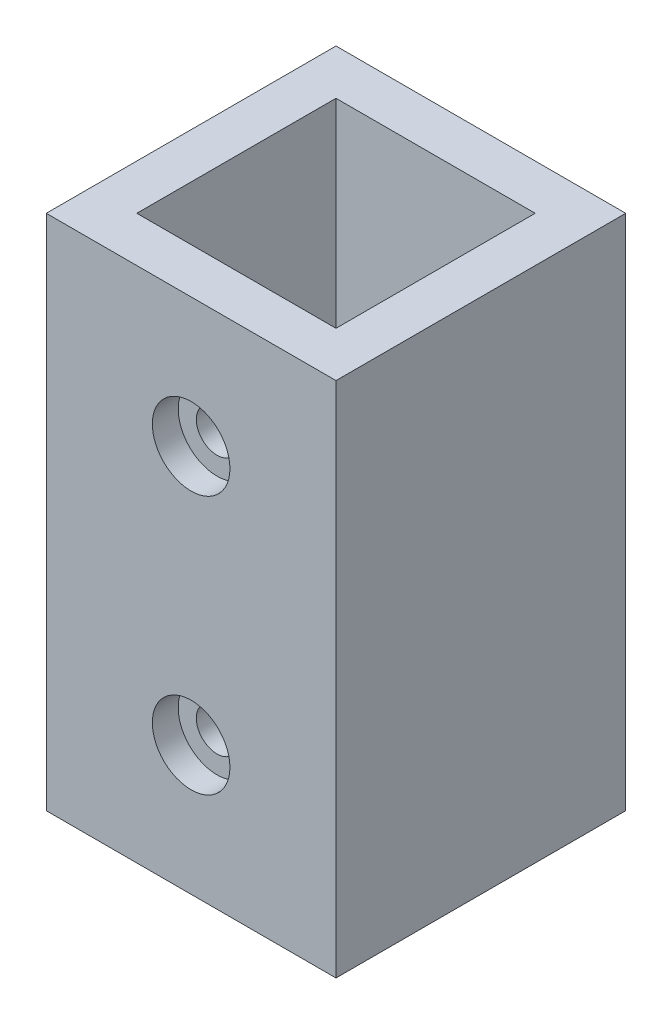
ISO-10303-21;
HEADER;
FILE_DESCRIPTION(('STEP AP214'),'2;1');
FILE_NAME('part.step','',(''),(''),'','','');
FILE_SCHEMA(('AUTOMOTIVE_DESIGN { 1 0 10303 214 1 1 1 1 }'));
ENDSEC;
DATA;
#1=APPLICATION_CONTEXT('core data for automotive mechanical design processes');
#2=APPLICATION_PROTOCOL_DEFINITION('international standard','automotive_design',2000,#1);
#3=PRODUCT_CONTEXT('',#1,'mechanical');
#4=PRODUCT('Part','Part','',(#3));
#5=PRODUCT_RELATED_PRODUCT_CATEGORY('part','',(#4));
#6=PRODUCT_DEFINITION_FORMATION('','',#4);
#7=PRODUCT_DEFINITION_CONTEXT('part definition',#1,'design');
#8=PRODUCT_DEFINITION('design','',#6,#7);
#9=PRODUCT_DEFINITION_SHAPE('','',#8);
#10=(LENGTH_UNIT() NAMED_UNIT(*) SI_UNIT(.MILLI.,.METRE.));
#11=(NAMED_UNIT(*) PLANE_ANGLE_UNIT() SI_UNIT($,.RADIAN.));
#12=(NAMED_UNIT(*) SI_UNIT($,.STERADIAN.) SOLID_ANGLE_UNIT());
#13=UNCERTAINTY_MEASURE_WITH_UNIT(LENGTH_MEASURE(1.E-05),#10,'distance_accuracy_value','');
#14=(GEOMETRIC_REPRESENTATION_CONTEXT(3) GLOBAL_UNCERTAINTY_ASSIGNED_CONTEXT((#13)) GLOBAL_UNIT_ASSIGNED_CONTEXT((#10,
#11,#12)) REPRESENTATION_CONTEXT('',''));
#15=CARTESIAN_POINT('',(0.,0.,0.));
#16=DIRECTION('',(0.,0.,1.));
#17=DIRECTION('',(1.,0.,0.));
#18=AXIS2_PLACEMENT_3D('',#15,#16,#17);
#19=CARTESIAN_POINT('',(0.,10.,11.2));
#20=DIRECTION('',(0.,0.,-1.));
#21=DIRECTION('',(-1.,0.,0.));
#22=AXIS2_PLACEMENT_3D('',#19,#20,#21);
#23=CYLINDRICAL_SURFACE('',#22,1.6);
#24=CARTESIAN_POINT('',(0.,10.,7.7));
#25=DIRECTION('',(0.,0.,1.));
#26=DIRECTION('',(1.,0.,0.));
#27=AXIS2_PLACEMENT_3D('',#24,#25,#26);
#28=CIRCLE('',#27,1.6);
#29=CARTESIAN_POINT('',(1.6,10.,7.7));
#30=VERTEX_POINT('',#29);
#31=EDGE_CURVE('E132',#30,#30,#28,.T.);
#32=ORIENTED_EDGE('',*,*,#31,.F.);
#33=EDGE_LOOP('',(#32));
#34=FACE_BOUND('',#33,.T.);
#35=CARTESIAN_POINT('',(0.,10.,9.2));
#36=DIRECTION('',(0.,0.,1.));
#37=DIRECTION('',(1.,0.,0.));
#38=AXIS2_PLACEMENT_3D('',#35,#36,#37);
#39=CIRCLE('',#38,1.6);
#40=CARTESIAN_POINT('',(1.6,10.,9.2));
#41=VERTEX_POINT('',#40);
#42=EDGE_CURVE('E40',#41,#41,#39,.F.);
#43=ORIENTED_EDGE('',*,*,#42,.F.);
#44=EDGE_LOOP('',(#43));
#45=FACE_BOUND('',#44,.T.);
#46=ADVANCED_FACE('F36',(#34,#45),#23,.F.);
#47=CARTESIAN_POINT('',(0.,30.,11.2));
#48=DIRECTION('',(0.,0.,-1.));
#49=DIRECTION('',(-1.,0.,0.));
#50=AXIS2_PLACEMENT_3D('',#47,#48,#49);
#51=CYLINDRICAL_SURFACE('',#50,1.6);
#52=CARTESIAN_POINT('',(0.,30.,7.7));
#53=DIRECTION('',(0.,0.,1.));
#54=DIRECTION('',(1.,0.,0.));
#55=AXIS2_PLACEMENT_3D('',#52,#53,#54);
#56=CIRCLE('',#55,1.6);
#57=CARTESIAN_POINT('',(1.6,30.,7.7));
#58=VERTEX_POINT('',#57);
#59=EDGE_CURVE('E185',#58,#58,#56,.T.);
#60=ORIENTED_EDGE('',*,*,#59,.F.);
#61=EDGE_LOOP('',(#60));
#62=FACE_BOUND('',#61,.T.);
#63=CARTESIAN_POINT('',(0.,30.,9.2));
#64=DIRECTION('',(0.,0.,1.));
#65=DIRECTION('',(1.,0.,0.));
#66=AXIS2_PLACEMENT_3D('',#63,#64,#65);
#67=CIRCLE('',#66,1.6);
#68=CARTESIAN_POINT('',(1.6,30.,9.2));
#69=VERTEX_POINT('',#68);
#70=EDGE_CURVE('E158',#69,#69,#67,.F.);
#71=ORIENTED_EDGE('',*,*,#70,.F.);
#72=EDGE_LOOP('',(#71));
#73=FACE_BOUND('',#72,.T.);
#74=ADVANCED_FACE('F226',(#62,#73),#51,.F.);
#75=CARTESIAN_POINT('',(0.,10.,-7.7));
#76=DIRECTION('',(0.,0.,-1.));
#77=DIRECTION('',(-1.,0.,0.));
#78=AXIS2_PLACEMENT_3D('',#75,#76,#77);
#79=CIRCLE('',#78,1.6);
#80=CARTESIAN_POINT('',(-1.6,10.,-7.7));
#81=VERTEX_POINT('',#80);
#82=EDGE_CURVE('E188',#81,#81,#79,.T.);
#83=ORIENTED_EDGE('',*,*,#82,.F.);
#84=EDGE_LOOP('',(#83));
#85=FACE_BOUND('',#84,.T.);
#86=CARTESIAN_POINT('',(0.,10.,-9.2));
#87=DIRECTION('',(0.,0.,-1.));
#88=DIRECTION('',(-1.,0.,0.));
#89=AXIS2_PLACEMENT_3D('',#86,#87,#88);
#90=CIRCLE('',#89,1.6);
#91=CARTESIAN_POINT('',(-1.6,10.,-9.2));
#92=VERTEX_POINT('',#91);
#93=EDGE_CURVE('E154',#92,#92,#90,.F.);
#94=ORIENTED_EDGE('',*,*,#93,.F.);
#95=EDGE_LOOP('',(#94));
#96=FACE_BOUND('',#95,.T.);
#97=ADVANCED_FACE('F229',(#85,#96),#23,.F.);
#98=CARTESIAN_POINT('',(0.,30.,-7.7));
#99=DIRECTION('',(0.,0.,-1.));
#100=DIRECTION('',(-1.,0.,0.));
#101=AXIS2_PLACEMENT_3D('',#98,#99,#100);
#102=CIRCLE('',#101,1.6);
#103=CARTESIAN_POINT('',(-1.6,30.,-7.7));
#104=VERTEX_POINT('',#103);
#105=EDGE_CURVE('E152',#104,#104,#102,.T.);
#106=ORIENTED_EDGE('',*,*,#105,.F.);
#107=EDGE_LOOP('',(#106));
#108=FACE_BOUND('',#107,.T.);
#109=CARTESIAN_POINT('',(0.,30.,-9.2));
#110=DIRECTION('',(0.,0.,-1.));
#111=DIRECTION('',(-1.,0.,0.));
#112=AXIS2_PLACEMENT_3D('',#109,#110,#111);
#113=CIRCLE('',#112,1.6);
#114=CARTESIAN_POINT('',(-1.6,30.,-9.2));
#115=VERTEX_POINT('',#114);
#116=EDGE_CURVE('E149',#115,#115,#113,.F.);
#117=ORIENTED_EDGE('',*,*,#116,.F.);
#118=EDGE_LOOP('',(#117));
#119=FACE_BOUND('',#118,.T.);
#120=ADVANCED_FACE('F235',(#108,#119),#51,.F.);
#121=CARTESIAN_POINT('',(7.7,40.,0.));
#122=DIRECTION('',(1.,0.,0.));
#123=DIRECTION('',(0.,0.,-1.));
#124=AXIS2_PLACEMENT_3D('',#121,#122,#123);
#125=PLANE('',#124);
#126=DIRECTION('',(0.,-1.,0.));
#127=VECTOR('',#126,1.);
#128=CARTESIAN_POINT('',(7.7,40.,-7.7));
#129=LINE('',#128,#127);
#130=CARTESIAN_POINT('',(7.7,40.,-7.7));
#131=VERTEX_POINT('',#130);
#132=CARTESIAN_POINT('',(7.7,0.,-7.7));
#133=VERTEX_POINT('',#132);
#134=EDGE_CURVE('E135',#131,#133,#129,.T.);
#135=ORIENTED_EDGE('',*,*,#134,.T.);
#136=DIRECTION('',(0.,0.,-1.));
#137=VECTOR('',#136,1.);
#138=CARTESIAN_POINT('',(7.7,0.,-7.7));
#139=LINE('',#138,#137);
#140=CARTESIAN_POINT('',(7.7,0.,7.7));
#141=VERTEX_POINT('',#140);
#142=EDGE_CURVE('E320',#141,#133,#139,.T.);
#143=ORIENTED_EDGE('',*,*,#142,.F.);
#144=DIRECTION('',(0.,-1.,0.));
#145=VECTOR('',#144,1.);
#146=CARTESIAN_POINT('',(7.7,40.,7.7));
#147=LINE('',#146,#145);
#148=CARTESIAN_POINT('',(7.7,40.,7.7));
#149=VERTEX_POINT('',#148);
#150=EDGE_CURVE('E119',#149,#141,#147,.T.);
#151=ORIENTED_EDGE('',*,*,#150,.F.);
#152=DIRECTION('',(0.,0.,1.));
#153=VECTOR('',#152,1.);
#154=CARTESIAN_POINT('',(7.7,40.,0.));
#155=LINE('',#154,#153);
#156=EDGE_CURVE('E110',#131,#149,#155,.T.);
#157=ORIENTED_EDGE('',*,*,#156,.F.);
#158=EDGE_LOOP('',(#135,#143,#151,#157));
#159=FACE_BOUND('',#158,.T.);
#160=ADVANCED_FACE('F244',(#159),#125,.F.);
#161=CARTESIAN_POINT('',(0.,40.,7.7));
#162=DIRECTION('',(0.,0.,1.));
#163=DIRECTION('',(1.,0.,0.));
#164=AXIS2_PLACEMENT_3D('',#161,#162,#163);
#165=PLANE('',#164);
#166=ORIENTED_EDGE('',*,*,#59,.T.);
#167=EDGE_LOOP('',(#166));
#168=FACE_BOUND('',#167,.T.);
#169=ORIENTED_EDGE('',*,*,#31,.T.);
#170=EDGE_LOOP('',(#169));
#171=FACE_BOUND('',#170,.T.);
#172=ORIENTED_EDGE('',*,*,#150,.T.);
#173=DIRECTION('',(1.,0.,0.));
#174=VECTOR('',#173,1.);
#175=CARTESIAN_POINT('',(7.7,0.,7.7));
#176=LINE('',#175,#174);
#177=CARTESIAN_POINT('',(-7.7,0.,7.7));
#178=VERTEX_POINT('',#177);
#179=EDGE_CURVE('E117',#178,#141,#176,.T.);
#180=ORIENTED_EDGE('',*,*,#179,.F.);
#181=DIRECTION('',(0.,-1.,0.));
#182=VECTOR('',#181,1.);
#183=CARTESIAN_POINT('',(-7.7,40.,7.7));
#184=LINE('',#183,#182);
#185=CARTESIAN_POINT('',(-7.7,40.,7.7));
#186=VERTEX_POINT('',#185);
#187=EDGE_CURVE('E53',#186,#178,#184,.T.);
#188=ORIENTED_EDGE('',*,*,#187,.F.);
#189=DIRECTION('',(-1.,0.,0.));
#190=VECTOR('',#189,1.);
#191=CARTESIAN_POINT('',(0.,40.,7.7));
#192=LINE('',#191,#190);
#193=EDGE_CURVE('E106',#149,#186,#192,.T.);
#194=ORIENTED_EDGE('',*,*,#193,.F.);
#195=EDGE_LOOP('',(#172,#180,#188,#194));
#196=FACE_BOUND('',#195,.T.);
#197=ADVANCED_FACE('F115',(#168,#171,#196),#165,.F.);
#198=CARTESIAN_POINT('',(-7.7,40.,0.));
#199=DIRECTION('',(1.,0.,0.));
#200=DIRECTION('',(0.,0.,-1.));
#201=AXIS2_PLACEMENT_3D('',#198,#199,#200);
#202=PLANE('',#201);
#203=ORIENTED_EDGE('',*,*,#187,.T.);
#204=DIRECTION('',(0.,0.,1.));
#205=VECTOR('',#204,1.);
#206=CARTESIAN_POINT('',(-7.7,0.,7.7));
#207=LINE('',#206,#205);
#208=CARTESIAN_POINT('',(-7.7,0.,-7.7));
#209=VERTEX_POINT('',#208);
#210=EDGE_CURVE('E325',#209,#178,#207,.T.);
#211=ORIENTED_EDGE('',*,*,#210,.F.);
#212=DIRECTION('',(0.,-1.,0.));
#213=VECTOR('',#212,1.);
#214=CARTESIAN_POINT('',(-7.7,40.,-7.7));
#215=LINE('',#214,#213);
#216=CARTESIAN_POINT('',(-7.7,40.,-7.7));
#217=VERTEX_POINT('',#216);
#218=EDGE_CURVE('E120',#217,#209,#215,.T.);
#219=ORIENTED_EDGE('',*,*,#218,.F.);
#220=DIRECTION('',(0.,0.,1.));
#221=VECTOR('',#220,1.);
#222=CARTESIAN_POINT('',(-7.7,40.,0.));
#223=LINE('',#222,#221);
#224=EDGE_CURVE('E108',#217,#186,#223,.T.);
#225=ORIENTED_EDGE('',*,*,#224,.T.);
#226=EDGE_LOOP('',(#203,#211,#219,#225));
#227=FACE_BOUND('',#226,.T.);
#228=ADVANCED_FACE('F122',(#227),#202,.T.);
#229=CARTESIAN_POINT('',(11.2,40.,0.));
#230=DIRECTION('',(1.,0.,0.));
#231=DIRECTION('',(0.,0.,-1.));
#232=AXIS2_PLACEMENT_3D('',#229,#230,#231);
#233=PLANE('',#232);
#234=DIRECTION('',(0.,0.,1.));
#235=VECTOR('',#234,1.);
#236=CARTESIAN_POINT('',(11.2,0.,0.));
#237=LINE('',#236,#235);
#238=CARTESIAN_POINT('',(11.2,0.,-11.2));
#239=VERTEX_POINT('',#238);
#240=CARTESIAN_POINT('',(11.2,0.,11.2));
#241=VERTEX_POINT('',#240);
#242=EDGE_CURVE('E129',#239,#241,#237,.T.);
#243=ORIENTED_EDGE('',*,*,#242,.F.);
#244=DIRECTION('',(0.,-1.,0.));
#245=VECTOR('',#244,1.);
#246=CARTESIAN_POINT('',(11.2,40.,-11.2));
#247=LINE('',#246,#245);
#248=CARTESIAN_POINT('',(11.2,40.,-11.2));
#249=VERTEX_POINT('',#248);
#250=EDGE_CURVE('E144',#249,#239,#247,.T.);
#251=ORIENTED_EDGE('',*,*,#250,.F.);
#252=DIRECTION('',(0.,0.,1.));
#253=VECTOR('',#252,1.);
#254=CARTESIAN_POINT('',(11.2,40.,0.));
#255=LINE('',#254,#253);
#256=CARTESIAN_POINT('',(11.2,40.,11.2));
#257=VERTEX_POINT('',#256);
#258=EDGE_CURVE('E194',#249,#257,#255,.T.);
#259=ORIENTED_EDGE('',*,*,#258,.T.);
#260=DIRECTION('',(0.,-1.,0.));
#261=VECTOR('',#260,1.);
#262=CARTESIAN_POINT('',(11.2,40.,11.2));
#263=LINE('',#262,#261);
#264=EDGE_CURVE('E90',#257,#241,#263,.T.);
#265=ORIENTED_EDGE('',*,*,#264,.T.);
#266=EDGE_LOOP('',(#243,#251,#259,#265));
#267=FACE_BOUND('',#266,.T.);
#268=ADVANCED_FACE('F214',(#267),#233,.T.);
#269=CARTESIAN_POINT('',(-11.2,40.,0.));
#270=DIRECTION('',(-1.,0.,0.));
#271=DIRECTION('',(0.,0.,1.));
#272=AXIS2_PLACEMENT_3D('',#269,#270,#271);
#273=PLANE('',#272);
#274=DIRECTION('',(0.,0.,-1.));
#275=VECTOR('',#274,1.);
#276=CARTESIAN_POINT('',(-11.2,0.,0.));
#277=LINE('',#276,#275);
#278=CARTESIAN_POINT('',(-11.2,0.,11.2));
#279=VERTEX_POINT('',#278);
#280=CARTESIAN_POINT('',(-11.2,0.,-11.2));
#281=VERTEX_POINT('',#280);
#282=EDGE_CURVE('E131',#279,#281,#277,.T.);
#283=ORIENTED_EDGE('',*,*,#282,.F.);
#284=DIRECTION('',(0.,-1.,0.));
#285=VECTOR('',#284,1.);
#286=CARTESIAN_POINT('',(-11.2,40.,11.2));
#287=LINE('',#286,#285);
#288=CARTESIAN_POINT('',(-11.2,40.,11.2));
#289=VERTEX_POINT('',#288);
#290=EDGE_CURVE('E125',#289,#279,#287,.T.);
#291=ORIENTED_EDGE('',*,*,#290,.F.);
#292=DIRECTION('',(0.,0.,-1.));
#293=VECTOR('',#292,1.);
#294=CARTESIAN_POINT('',(-11.2,40.,0.));
#295=LINE('',#294,#293);
#296=CARTESIAN_POINT('',(-11.2,40.,-11.2));
#297=VERTEX_POINT('',#296);
#298=EDGE_CURVE('E200',#289,#297,#295,.T.);
#299=ORIENTED_EDGE('',*,*,#298,.T.);
#300=DIRECTION('',(0.,-1.,0.));
#301=VECTOR('',#300,1.);
#302=CARTESIAN_POINT('',(-11.2,40.,-11.2));
#303=LINE('',#302,#301);
#304=EDGE_CURVE('E141',#297,#281,#303,.T.);
#305=ORIENTED_EDGE('',*,*,#304,.T.);
#306=EDGE_LOOP('',(#283,#291,#299,#305));
#307=FACE_BOUND('',#306,.T.);
#308=ADVANCED_FACE('F205',(#307),#273,.T.);
#309=CARTESIAN_POINT('',(0.,40.,-7.7));
#310=DIRECTION('',(0.,0.,-1.));
#311=DIRECTION('',(-1.,0.,0.));
#312=AXIS2_PLACEMENT_3D('',#309,#310,#311);
#313=PLANE('',#312);
#314=ORIENTED_EDGE('',*,*,#105,.T.);
#315=EDGE_LOOP('',(#314));
#316=FACE_BOUND('',#315,.T.);
#317=ORIENTED_EDGE('',*,*,#82,.T.);
#318=EDGE_LOOP('',(#317));
#319=FACE_BOUND('',#318,.T.);
#320=ORIENTED_EDGE('',*,*,#218,.T.);
#321=DIRECTION('',(-1.,0.,0.));
#322=VECTOR('',#321,1.);
#323=CARTESIAN_POINT('',(-7.7,0.,-7.7));
#324=LINE('',#323,#322);
#325=EDGE_CURVE('E329',#133,#209,#324,.T.);
#326=ORIENTED_EDGE('',*,*,#325,.F.);
#327=ORIENTED_EDGE('',*,*,#134,.F.);
#328=DIRECTION('',(1.,0.,0.));
#329=VECTOR('',#328,1.);
#330=CARTESIAN_POINT('',(0.,40.,-7.7));
#331=LINE('',#330,#329);
#332=EDGE_CURVE('E62',#217,#131,#331,.T.);
#333=ORIENTED_EDGE('',*,*,#332,.F.);
#334=EDGE_LOOP('',(#320,#326,#327,#333));
#335=FACE_BOUND('',#334,.T.);
#336=ADVANCED_FACE('F221',(#316,#319,#335),#313,.F.);
#337=CARTESIAN_POINT('',(0.,40.,0.));
#338=DIRECTION('',(0.,1.,0.));
#339=DIRECTION('',(0.,0.,1.));
#340=AXIS2_PLACEMENT_3D('',#337,#338,#339);
#341=PLANE('',#340);
#342=DIRECTION('',(-1.,0.,0.));
#343=VECTOR('',#342,1.);
#344=CARTESIAN_POINT('',(0.,40.,11.2));
#345=LINE('',#344,#343);
#346=EDGE_CURVE('E134',#257,#289,#345,.T.);
#347=ORIENTED_EDGE('',*,*,#346,.F.);
#348=ORIENTED_EDGE('',*,*,#258,.F.);
#349=DIRECTION('',(1.,0.,0.));
#350=VECTOR('',#349,1.);
#351=CARTESIAN_POINT('',(0.,40.,-11.2));
#352=LINE('',#351,#350);
#353=EDGE_CURVE('E197',#297,#249,#352,.T.);
#354=ORIENTED_EDGE('',*,*,#353,.F.);
#355=ORIENTED_EDGE('',*,*,#298,.F.);
#356=EDGE_LOOP('',(#347,#348,#354,#355));
#357=FACE_BOUND('',#356,.T.);
#358=ORIENTED_EDGE('',*,*,#156,.T.);
#359=ORIENTED_EDGE('',*,*,#193,.T.);
#360=ORIENTED_EDGE('',*,*,#224,.F.);
#361=ORIENTED_EDGE('',*,*,#332,.T.);
#362=EDGE_LOOP('',(#358,#359,#360,#361));
#363=FACE_BOUND('',#362,.T.);
#364=ADVANCED_FACE('F107',(#357,#363),#341,.T.);
#365=CARTESIAN_POINT('',(0.,3.,11.2));
#366=DIRECTION('',(0.,0.,1.));
#367=DIRECTION('',(1.,0.,0.));
#368=AXIS2_PLACEMENT_3D('',#365,#366,#367);
#369=PLANE('',#368);
#370=CARTESIAN_POINT('',(0.,10.,11.2));
#371=DIRECTION('',(0.,0.,1.));
#372=DIRECTION('',(1.,0.,0.));
#373=AXIS2_PLACEMENT_3D('',#370,#371,#372);
#374=CIRCLE('',#373,3.);
#375=CARTESIAN_POINT('',(3.,10.,11.2));
#376=VERTEX_POINT('',#375);
#377=EDGE_CURVE('E174',#376,#376,#374,.T.);
#378=ORIENTED_EDGE('',*,*,#377,.F.);
#379=EDGE_LOOP('',(#378));
#380=FACE_BOUND('',#379,.T.);
#381=CARTESIAN_POINT('',(0.,30.,11.2));
#382=DIRECTION('',(0.,0.,1.));
#383=DIRECTION('',(1.,0.,0.));
#384=AXIS2_PLACEMENT_3D('',#381,#382,#383);
#385=CIRCLE('',#384,3.);
#386=CARTESIAN_POINT('',(3.,30.,11.2));
#387=VERTEX_POINT('',#386);
#388=EDGE_CURVE('E167',#387,#387,#385,.T.);
#389=ORIENTED_EDGE('',*,*,#388,.F.);
#390=EDGE_LOOP('',(#389));
#391=FACE_BOUND('',#390,.T.);
#392=ORIENTED_EDGE('',*,*,#290,.T.);
#393=DIRECTION('',(-1.,0.,0.));
#394=VECTOR('',#393,1.);
#395=CARTESIAN_POINT('',(0.,0.,11.2));
#396=LINE('',#395,#394);
#397=EDGE_CURVE('E45',#241,#279,#396,.T.);
#398=ORIENTED_EDGE('',*,*,#397,.F.);
#399=ORIENTED_EDGE('',*,*,#264,.F.);
#400=ORIENTED_EDGE('',*,*,#346,.T.);
#401=EDGE_LOOP('',(#392,#398,#399,#400));
#402=FACE_BOUND('',#401,.T.);
#403=ADVANCED_FACE('F38',(#380,#391,#402),#369,.T.);
#404=CARTESIAN_POINT('',(0.,3.,-11.2));
#405=DIRECTION('',(0.,0.,-1.));
#406=DIRECTION('',(-1.,0.,0.));
#407=AXIS2_PLACEMENT_3D('',#404,#405,#406);
#408=PLANE('',#407);
#409=CARTESIAN_POINT('',(0.,10.,-11.2));
#410=DIRECTION('',(0.,0.,-1.));
#411=DIRECTION('',(-1.,0.,0.));
#412=AXIS2_PLACEMENT_3D('',#409,#410,#411);
#413=CIRCLE('',#412,3.);
#414=CARTESIAN_POINT('',(-3.,10.,-11.2));
#415=VERTEX_POINT('',#414);
#416=EDGE_CURVE('E160',#415,#415,#413,.T.);
#417=ORIENTED_EDGE('',*,*,#416,.F.);
#418=EDGE_LOOP('',(#417));
#419=FACE_BOUND('',#418,.T.);
#420=CARTESIAN_POINT('',(0.,30.,-11.2));
#421=DIRECTION('',(0.,0.,-1.));
#422=DIRECTION('',(-1.,0.,0.));
#423=AXIS2_PLACEMENT_3D('',#420,#421,#422);
#424=CIRCLE('',#423,3.);
#425=CARTESIAN_POINT('',(-3.,30.,-11.2));
#426=VERTEX_POINT('',#425);
#427=EDGE_CURVE('E156',#426,#426,#424,.T.);
#428=ORIENTED_EDGE('',*,*,#427,.F.);
#429=EDGE_LOOP('',(#428));
#430=FACE_BOUND('',#429,.T.);
#431=ORIENTED_EDGE('',*,*,#250,.T.);
#432=DIRECTION('',(1.,0.,0.));
#433=VECTOR('',#432,1.);
#434=CARTESIAN_POINT('',(0.,0.,-11.2));
#435=LINE('',#434,#433);
#436=EDGE_CURVE('E11',#281,#239,#435,.T.);
#437=ORIENTED_EDGE('',*,*,#436,.F.);
#438=ORIENTED_EDGE('',*,*,#304,.F.);
#439=ORIENTED_EDGE('',*,*,#353,.T.);
#440=EDGE_LOOP('',(#431,#437,#438,#439));
#441=FACE_BOUND('',#440,.T.);
#442=ADVANCED_FACE('F210',(#419,#430,#441),#408,.T.);
#443=CARTESIAN_POINT('',(0.,0.,0.));
#444=DIRECTION('',(0.,1.,0.));
#445=DIRECTION('',(0.,0.,1.));
#446=AXIS2_PLACEMENT_3D('',#443,#444,#445);
#447=PLANE('',#446);
#448=ORIENTED_EDGE('',*,*,#142,.T.);
#449=ORIENTED_EDGE('',*,*,#325,.T.);
#450=ORIENTED_EDGE('',*,*,#210,.T.);
#451=ORIENTED_EDGE('',*,*,#179,.T.);
#452=EDGE_LOOP('',(#448,#449,#450,#451));
#453=FACE_BOUND('',#452,.T.);
#454=ORIENTED_EDGE('',*,*,#436,.T.);
#455=ORIENTED_EDGE('',*,*,#242,.T.);
#456=ORIENTED_EDGE('',*,*,#397,.T.);
#457=ORIENTED_EDGE('',*,*,#282,.T.);
#458=EDGE_LOOP('',(#454,#455,#456,#457));
#459=FACE_BOUND('',#458,.T.);
#460=ADVANCED_FACE('F212',(#453,#459),#447,.F.);
#461=CARTESIAN_POINT('',(0.,30.,-9.2));
#462=DIRECTION('',(0.,0.,-1.));
#463=DIRECTION('',(-1.,0.,0.));
#464=AXIS2_PLACEMENT_3D('',#461,#462,#463);
#465=PLANE('',#464);
#466=CARTESIAN_POINT('',(0.,30.,-9.2));
#467=DIRECTION('',(0.,0.,-1.));
#468=DIRECTION('',(-1.,0.,0.));
#469=AXIS2_PLACEMENT_3D('',#466,#467,#468);
#470=CIRCLE('',#469,3.);
#471=CARTESIAN_POINT('',(-3.,30.,-9.2));
#472=VERTEX_POINT('',#471);
#473=EDGE_CURVE('E153',#472,#472,#470,.T.);
#474=ORIENTED_EDGE('',*,*,#473,.T.);
#475=EDGE_LOOP('',(#474));
#476=FACE_BOUND('',#475,.T.);
#477=ORIENTED_EDGE('',*,*,#116,.T.);
#478=EDGE_LOOP('',(#477));
#479=FACE_BOUND('',#478,.T.);
#480=ADVANCED_FACE('F263',(#476,#479),#465,.T.);
#481=CARTESIAN_POINT('',(0.,30.,-9.2));
#482=DIRECTION('',(0.,0.,-1.));
#483=DIRECTION('',(-1.,0.,0.));
#484=AXIS2_PLACEMENT_3D('',#481,#482,#483);
#485=CYLINDRICAL_SURFACE('',#484,3.);
#486=ORIENTED_EDGE('',*,*,#473,.F.);
#487=EDGE_LOOP('',(#486));
#488=FACE_BOUND('',#487,.T.);
#489=ORIENTED_EDGE('',*,*,#427,.T.);
#490=EDGE_LOOP('',(#489));
#491=FACE_BOUND('',#490,.T.);
#492=ADVANCED_FACE('F253',(#488,#491),#485,.F.);
#493=CARTESIAN_POINT('',(0.,10.,-9.2));
#494=DIRECTION('',(0.,0.,-1.));
#495=DIRECTION('',(-1.,0.,0.));
#496=AXIS2_PLACEMENT_3D('',#493,#494,#495);
#497=PLANE('',#496);
#498=CARTESIAN_POINT('',(0.,10.,-9.2));
#499=DIRECTION('',(0.,0.,-1.));
#500=DIRECTION('',(-1.,0.,0.));
#501=AXIS2_PLACEMENT_3D('',#498,#499,#500);
#502=CIRCLE('',#501,3.);
#503=CARTESIAN_POINT('',(-3.,10.,-9.2));
#504=VERTEX_POINT('',#503);
#505=EDGE_CURVE('E157',#504,#504,#502,.T.);
#506=ORIENTED_EDGE('',*,*,#505,.T.);
#507=EDGE_LOOP('',(#506));
#508=FACE_BOUND('',#507,.T.);
#509=ORIENTED_EDGE('',*,*,#93,.T.);
#510=EDGE_LOOP('',(#509));
#511=FACE_BOUND('',#510,.T.);
#512=ADVANCED_FACE('F250',(#508,#511),#497,.T.);
#513=CARTESIAN_POINT('',(0.,10.,-9.2));
#514=DIRECTION('',(0.,0.,-1.));
#515=DIRECTION('',(-1.,0.,0.));
#516=AXIS2_PLACEMENT_3D('',#513,#514,#515);
#517=CYLINDRICAL_SURFACE('',#516,3.);
#518=ORIENTED_EDGE('',*,*,#505,.F.);
#519=EDGE_LOOP('',(#518));
#520=FACE_BOUND('',#519,.T.);
#521=ORIENTED_EDGE('',*,*,#416,.T.);
#522=EDGE_LOOP('',(#521));
#523=FACE_BOUND('',#522,.T.);
#524=ADVANCED_FACE('F252',(#520,#523),#517,.F.);
#525=CARTESIAN_POINT('',(0.,30.,9.2));
#526=DIRECTION('',(0.,0.,1.));
#527=DIRECTION('',(1.,0.,0.));
#528=AXIS2_PLACEMENT_3D('',#525,#526,#527);
#529=PLANE('',#528);
#530=CARTESIAN_POINT('',(0.,30.,9.2));
#531=DIRECTION('',(0.,0.,1.));
#532=DIRECTION('',(1.,0.,0.));
#533=AXIS2_PLACEMENT_3D('',#530,#531,#532);
#534=CIRCLE('',#533,3.);
#535=CARTESIAN_POINT('',(3.,30.,9.2));
#536=VERTEX_POINT('',#535);
#537=EDGE_CURVE('E161',#536,#536,#534,.T.);
#538=ORIENTED_EDGE('',*,*,#537,.T.);
#539=EDGE_LOOP('',(#538));
#540=FACE_BOUND('',#539,.T.);
#541=ORIENTED_EDGE('',*,*,#70,.T.);
#542=EDGE_LOOP('',(#541));
#543=FACE_BOUND('',#542,.T.);
#544=ADVANCED_FACE('F260',(#540,#543),#529,.T.);
#545=CARTESIAN_POINT('',(0.,30.,9.2));
#546=DIRECTION('',(0.,0.,1.));
#547=DIRECTION('',(1.,0.,0.));
#548=AXIS2_PLACEMENT_3D('',#545,#546,#547);
#549=CYLINDRICAL_SURFACE('',#548,3.);
#550=ORIENTED_EDGE('',*,*,#537,.F.);
#551=EDGE_LOOP('',(#550));
#552=FACE_BOUND('',#551,.T.);
#553=ORIENTED_EDGE('',*,*,#388,.T.);
#554=EDGE_LOOP('',(#553));
#555=FACE_BOUND('',#554,.T.);
#556=ADVANCED_FACE('F267',(#552,#555),#549,.F.);
#557=CARTESIAN_POINT('',(0.,10.,9.2));
#558=DIRECTION('',(0.,0.,1.));
#559=DIRECTION('',(1.,0.,0.));
#560=AXIS2_PLACEMENT_3D('',#557,#558,#559);
#561=PLANE('',#560);
#562=CARTESIAN_POINT('',(0.,10.,9.2));
#563=DIRECTION('',(0.,0.,1.));
#564=DIRECTION('',(1.,0.,0.));
#565=AXIS2_PLACEMENT_3D('',#562,#563,#564);
#566=CIRCLE('',#565,3.);
#567=CARTESIAN_POINT('',(3.,10.,9.2));
#568=VERTEX_POINT('',#567);
#569=EDGE_CURVE('E319',#568,#568,#566,.T.);
#570=ORIENTED_EDGE('',*,*,#569,.T.);
#571=EDGE_LOOP('',(#570));
#572=FACE_BOUND('',#571,.T.);
#573=ORIENTED_EDGE('',*,*,#42,.T.);
#574=EDGE_LOOP('',(#573));
#575=FACE_BOUND('',#574,.T.);
#576=ADVANCED_FACE('F300',(#572,#575),#561,.T.);
#577=CARTESIAN_POINT('',(0.,10.,9.2));
#578=DIRECTION('',(0.,0.,1.));
#579=DIRECTION('',(1.,0.,0.));
#580=AXIS2_PLACEMENT_3D('',#577,#578,#579);
#581=CYLINDRICAL_SURFACE('',#580,3.);
#582=ORIENTED_EDGE('',*,*,#569,.F.);
#583=EDGE_LOOP('',(#582));
#584=FACE_BOUND('',#583,.T.);
#585=ORIENTED_EDGE('',*,*,#377,.T.);
#586=EDGE_LOOP('',(#585));
#587=FACE_BOUND('',#586,.T.);
#588=ADVANCED_FACE('F306',(#584,#587),#581,.F.);
#589=CLOSED_SHELL('',(#46,#74,#97,#120,#160,#197,#228,#268,#308,#336,#364,#403,#442,#460,#480,
#492,#512,#524,#544,#556,#576,#588));
#590=MANIFOLD_SOLID_BREP('B2',#589);
#591=ADVANCED_BREP_SHAPE_REPRESENTATION('',(#18,#590),#14);
#592=SHAPE_DEFINITION_REPRESENTATION(#9,#591);
ENDSEC;
END-ISO-10303-21;
